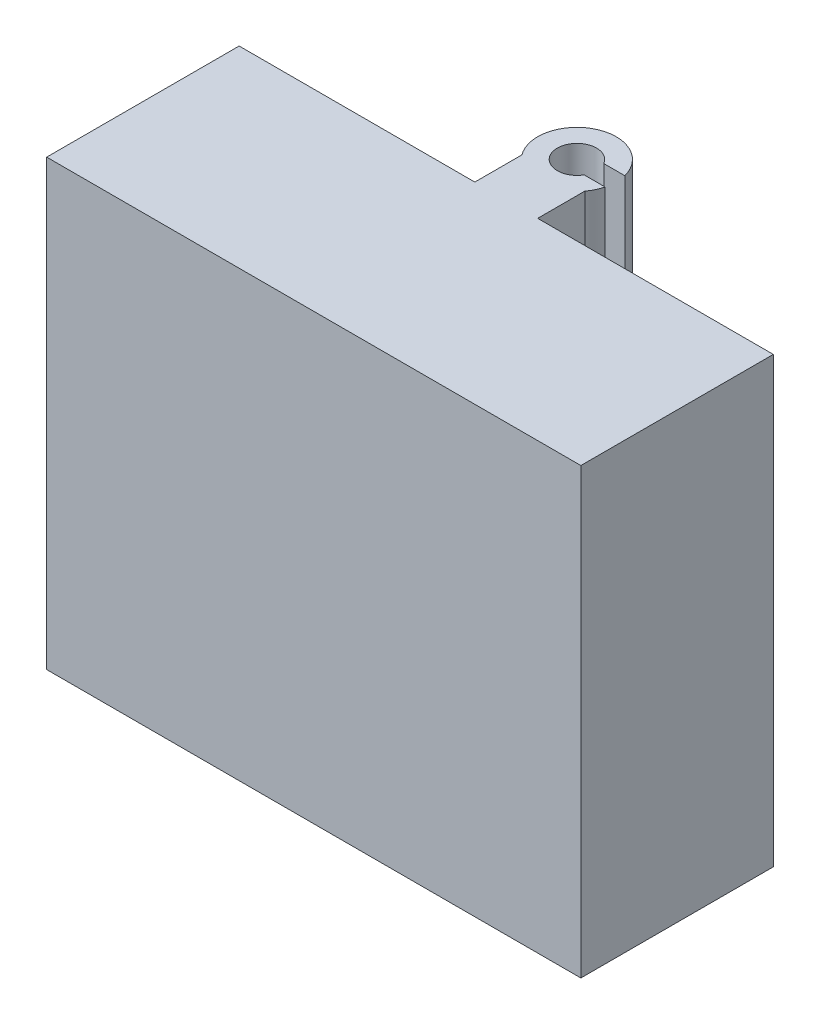
ISO-10303-21;
HEADER;
FILE_DESCRIPTION(('STEP AP214'),'2;1');
FILE_NAME('part.step','',(''),(''),'','','');
FILE_SCHEMA(('AUTOMOTIVE_DESIGN { 1 0 10303 214 1 1 1 1 }'));
ENDSEC;
DATA;
#1=APPLICATION_CONTEXT('core data for automotive mechanical design processes');
#2=APPLICATION_PROTOCOL_DEFINITION('international standard','automotive_design',2000,#1);
#3=PRODUCT_CONTEXT('',#1,'mechanical');
#4=PRODUCT('Part','Part','',(#3));
#5=PRODUCT_RELATED_PRODUCT_CATEGORY('part','',(#4));
#6=PRODUCT_DEFINITION_FORMATION('','',#4);
#7=PRODUCT_DEFINITION_CONTEXT('part definition',#1,'design');
#8=PRODUCT_DEFINITION('design','',#6,#7);
#9=PRODUCT_DEFINITION_SHAPE('','',#8);
#10=(LENGTH_UNIT() NAMED_UNIT(*) SI_UNIT(.MILLI.,.METRE.));
#11=(NAMED_UNIT(*) PLANE_ANGLE_UNIT() SI_UNIT($,.RADIAN.));
#12=(NAMED_UNIT(*) SI_UNIT($,.STERADIAN.) SOLID_ANGLE_UNIT());
#13=UNCERTAINTY_MEASURE_WITH_UNIT(LENGTH_MEASURE(1.E-05),#10,'distance_accuracy_value','');
#14=(GEOMETRIC_REPRESENTATION_CONTEXT(3) GLOBAL_UNCERTAINTY_ASSIGNED_CONTEXT((#13)) GLOBAL_UNIT_ASSIGNED_CONTEXT((#10,
#11,#12)) REPRESENTATION_CONTEXT('',''));
#15=CARTESIAN_POINT('',(0.,0.,0.));
#16=DIRECTION('',(0.,0.,1.));
#17=DIRECTION('',(1.,0.,0.));
#18=AXIS2_PLACEMENT_3D('',#15,#16,#17);
#19=CARTESIAN_POINT('',(38.,0.,-6.));
#20=DIRECTION('',(-1.,0.,0.));
#21=DIRECTION('',(0.,-1.,0.));
#22=AXIS2_PLACEMENT_3D('',#19,#20,#21);
#23=PLANE('',#22);
#24=DIRECTION('',(0.,0.,1.));
#25=VECTOR('',#24,1.);
#26=CARTESIAN_POINT('',(38.,-23.5,-6.));
#27=LINE('',#26,#25);
#28=CARTESIAN_POINT('',(38.,-23.5,-6.));
#29=VERTEX_POINT('',#28);
#30=CARTESIAN_POINT('',(38.,-23.5,0.));
#31=VERTEX_POINT('',#30);
#32=EDGE_CURVE('E158',#29,#31,#27,.T.);
#33=ORIENTED_EDGE('',*,*,#32,.F.);
#34=DIRECTION('',(0.,-1.,0.));
#35=VECTOR('',#34,1.);
#36=CARTESIAN_POINT('',(38.,0.,-6.));
#37=LINE('',#36,#35);
#38=CARTESIAN_POINT('',(38.,0.,-6.));
#39=VERTEX_POINT('',#38);
#40=EDGE_CURVE('E178',#39,#29,#37,.T.);
#41=ORIENTED_EDGE('',*,*,#40,.F.);
#42=DIRECTION('',(0.,0.,1.));
#43=VECTOR('',#42,1.);
#44=CARTESIAN_POINT('',(38.,0.,-6.));
#45=LINE('',#44,#43);
#46=CARTESIAN_POINT('',(38.,0.,0.));
#47=VERTEX_POINT('',#46);
#48=EDGE_CURVE('E188',#39,#47,#45,.T.);
#49=ORIENTED_EDGE('',*,*,#48,.T.);
#50=DIRECTION('',(0.,-1.,0.));
#51=VECTOR('',#50,1.);
#52=CARTESIAN_POINT('',(38.,0.,0.));
#53=LINE('',#52,#51);
#54=EDGE_CURVE('E64',#47,#31,#53,.T.);
#55=ORIENTED_EDGE('',*,*,#54,.T.);
#56=EDGE_LOOP('',(#33,#41,#49,#55));
#57=FACE_BOUND('',#56,.T.);
#58=ADVANCED_FACE('F41',(#57),#23,.F.);
#59=CARTESIAN_POINT('',(30.,0.,-6.));
#60=DIRECTION('',(1.,0.,0.));
#61=DIRECTION('',(0.,1.,0.));
#62=AXIS2_PLACEMENT_3D('',#59,#60,#61);
#63=PLANE('',#62);
#64=DIRECTION('',(0.,0.,-1.));
#65=VECTOR('',#64,1.);
#66=CARTESIAN_POINT('',(30.,-23.5,-6.));
#67=LINE('',#66,#65);
#68=CARTESIAN_POINT('',(30.,-23.5,0.));
#69=VERTEX_POINT('',#68);
#70=CARTESIAN_POINT('',(30.,-23.5,-6.));
#71=VERTEX_POINT('',#70);
#72=EDGE_CURVE('E156',#69,#71,#67,.T.);
#73=ORIENTED_EDGE('',*,*,#72,.F.);
#74=DIRECTION('',(0.,1.,0.));
#75=VECTOR('',#74,1.);
#76=CARTESIAN_POINT('',(30.,0.,0.));
#77=LINE('',#76,#75);
#78=CARTESIAN_POINT('',(30.,0.,0.));
#79=VERTEX_POINT('',#78);
#80=EDGE_CURVE('E166',#69,#79,#77,.T.);
#81=ORIENTED_EDGE('',*,*,#80,.T.);
#82=DIRECTION('',(0.,0.,1.));
#83=VECTOR('',#82,1.);
#84=CARTESIAN_POINT('',(30.,0.,-6.));
#85=LINE('',#84,#83);
#86=CARTESIAN_POINT('',(30.,0.,-6.));
#87=VERTEX_POINT('',#86);
#88=EDGE_CURVE('E192',#87,#79,#85,.T.);
#89=ORIENTED_EDGE('',*,*,#88,.F.);
#90=DIRECTION('',(0.,1.,0.));
#91=VECTOR('',#90,1.);
#92=CARTESIAN_POINT('',(30.,0.,-6.));
#93=LINE('',#92,#91);
#94=EDGE_CURVE('E168',#71,#87,#93,.T.);
#95=ORIENTED_EDGE('',*,*,#94,.F.);
#96=EDGE_LOOP('',(#73,#81,#89,#95));
#97=FACE_BOUND('',#96,.T.);
#98=ADVANCED_FACE('F164',(#97),#63,.F.);
#99=CARTESIAN_POINT('',(34.,-56.5,-9.));
#100=DIRECTION('',(0.,1.,0.));
#101=DIRECTION('',(0.,0.,1.));
#102=AXIS2_PLACEMENT_3D('',#99,#100,#101);
#103=CYLINDRICAL_SURFACE('',#102,2.49999282434763);
#104=CARTESIAN_POINT('',(34.,-23.5,-9.));
#105=DIRECTION('',(0.,-1.,0.));
#106=DIRECTION('',(0.,0.,-1.));
#107=AXIS2_PLACEMENT_3D('',#104,#105,#106);
#108=CIRCLE('',#107,2.49999282434763);
#109=CARTESIAN_POINT('',(36.1650552237275,-23.5,-10.25));
#110=VERTEX_POINT('',#109);
#111=CARTESIAN_POINT('',(36.1650552237275,-23.5,-7.75));
#112=VERTEX_POINT('',#111);
#113=EDGE_CURVE('E171',#110,#112,#108,.F.);
#114=ORIENTED_EDGE('',*,*,#113,.F.);
#115=DIRECTION('',(0.,1.,0.));
#116=VECTOR('',#115,1.);
#117=CARTESIAN_POINT('',(36.1650552237275,-56.5,-10.25));
#118=LINE('',#117,#116);
#119=CARTESIAN_POINT('',(36.1650552237275,0.,-10.25));
#120=VERTEX_POINT('',#119);
#121=EDGE_CURVE('E375',#110,#120,#118,.T.);
#122=ORIENTED_EDGE('',*,*,#121,.T.);
#123=CARTESIAN_POINT('',(34.,0.,-9.));
#124=DIRECTION('',(0.,1.,0.));
#125=DIRECTION('',(0.,0.,1.));
#126=AXIS2_PLACEMENT_3D('',#123,#124,#125);
#127=CIRCLE('',#126,2.49999282434763);
#128=CARTESIAN_POINT('',(36.1650552237275,0.,-7.75));
#129=VERTEX_POINT('',#128);
#130=EDGE_CURVE('E405',#120,#129,#127,.T.);
#131=ORIENTED_EDGE('',*,*,#130,.T.);
#132=DIRECTION('',(0.,1.,0.));
#133=VECTOR('',#132,1.);
#134=CARTESIAN_POINT('',(36.1650552237275,-56.5,-7.75));
#135=LINE('',#134,#133);
#136=EDGE_CURVE('E184',#112,#129,#135,.T.);
#137=ORIENTED_EDGE('',*,*,#136,.F.);
#138=EDGE_LOOP('',(#114,#122,#131,#137));
#139=FACE_BOUND('',#138,.T.);
#140=ADVANCED_FACE('F312',(#139),#103,.F.);
#141=CARTESIAN_POINT('',(0.,-56.5,-7.75));
#142=DIRECTION('',(0.,0.,1.));
#143=DIRECTION('',(1.,0.,0.));
#144=AXIS2_PLACEMENT_3D('',#141,#142,#143);
#145=PLANE('',#144);
#146=DIRECTION('',(1.,0.,0.));
#147=VECTOR('',#146,1.);
#148=CARTESIAN_POINT('',(0.,-23.5,-7.75));
#149=LINE('',#148,#147);
#150=CARTESIAN_POINT('',(38.8412291827593,-23.5,-7.75));
#151=VERTEX_POINT('',#150);
#152=EDGE_CURVE('E170',#112,#151,#149,.T.);
#153=ORIENTED_EDGE('',*,*,#152,.F.);
#154=ORIENTED_EDGE('',*,*,#136,.T.);
#155=DIRECTION('',(1.,0.,0.));
#156=VECTOR('',#155,1.);
#157=CARTESIAN_POINT('',(0.,0.,-7.75));
#158=LINE('',#157,#156);
#159=CARTESIAN_POINT('',(38.8412291827593,0.,-7.75));
#160=VERTEX_POINT('',#159);
#161=EDGE_CURVE('E386',#129,#160,#158,.T.);
#162=ORIENTED_EDGE('',*,*,#161,.T.);
#163=DIRECTION('',(0.,1.,0.));
#164=VECTOR('',#163,1.);
#165=CARTESIAN_POINT('',(38.8412291827593,-56.5,-7.75));
#166=LINE('',#165,#164);
#167=EDGE_CURVE('E390',#151,#160,#166,.T.);
#168=ORIENTED_EDGE('',*,*,#167,.F.);
#169=EDGE_LOOP('',(#153,#154,#162,#168));
#170=FACE_BOUND('',#169,.T.);
#171=ADVANCED_FACE('F366',(#170),#145,.F.);
#172=CARTESIAN_POINT('',(34.,-56.5,-9.));
#173=DIRECTION('',(0.,1.,0.));
#174=DIRECTION('',(0.,0.,1.));
#175=AXIS2_PLACEMENT_3D('',#172,#173,#174);
#176=CYLINDRICAL_SURFACE('',#175,5.);
#177=ORIENTED_EDGE('',*,*,#40,.T.);
#178=CARTESIAN_POINT('',(34.,-23.5,-9.));
#179=DIRECTION('',(0.,-1.,0.));
#180=DIRECTION('',(0.,0.,-1.));
#181=AXIS2_PLACEMENT_3D('',#178,#179,#180);
#182=CIRCLE('',#181,5.);
#183=EDGE_CURVE('E415',#29,#151,#182,.F.);
#184=ORIENTED_EDGE('',*,*,#183,.T.);
#185=ORIENTED_EDGE('',*,*,#167,.T.);
#186=CARTESIAN_POINT('',(34.,0.,-9.));
#187=DIRECTION('',(0.,1.,0.));
#188=DIRECTION('',(0.,0.,1.));
#189=AXIS2_PLACEMENT_3D('',#186,#187,#188);
#190=CIRCLE('',#189,5.);
#191=EDGE_CURVE('E393',#39,#160,#190,.T.);
#192=ORIENTED_EDGE('',*,*,#191,.F.);
#193=EDGE_LOOP('',(#177,#184,#185,#192));
#194=FACE_BOUND('',#193,.T.);
#195=ADVANCED_FACE('F360',(#194),#176,.T.);
#196=DIRECTION('',(0.,1.,0.));
#197=VECTOR('',#196,1.);
#198=CARTESIAN_POINT('',(38.8412291827593,-56.5,-10.25));
#199=LINE('',#198,#197);
#200=CARTESIAN_POINT('',(38.8412291827593,-23.5,-10.25));
#201=VERTEX_POINT('',#200);
#202=CARTESIAN_POINT('',(38.8412291827593,0.,-10.25));
#203=VERTEX_POINT('',#202);
#204=EDGE_CURVE('E385',#201,#203,#199,.T.);
#205=ORIENTED_EDGE('',*,*,#204,.F.);
#206=CARTESIAN_POINT('',(34.,-23.5,-9.));
#207=DIRECTION('',(0.,-1.,0.));
#208=DIRECTION('',(0.,0.,-1.));
#209=AXIS2_PLACEMENT_3D('',#206,#207,#208);
#210=CIRCLE('',#209,5.);
#211=EDGE_CURVE('E57',#201,#71,#210,.F.);
#212=ORIENTED_EDGE('',*,*,#211,.T.);
#213=ORIENTED_EDGE('',*,*,#94,.T.);
#214=EDGE_CURVE('E399',#203,#87,#190,.T.);
#215=ORIENTED_EDGE('',*,*,#214,.F.);
#216=EDGE_LOOP('',(#205,#212,#213,#215));
#217=FACE_BOUND('',#216,.T.);
#218=ADVANCED_FACE('F354',(#217),#176,.T.);
#219=CARTESIAN_POINT('',(0.,-56.5,-10.25));
#220=DIRECTION('',(0.,0.,1.));
#221=DIRECTION('',(1.,0.,0.));
#222=AXIS2_PLACEMENT_3D('',#219,#220,#221);
#223=PLANE('',#222);
#224=ORIENTED_EDGE('',*,*,#121,.F.);
#225=DIRECTION('',(1.,0.,0.));
#226=VECTOR('',#225,1.);
#227=CARTESIAN_POINT('',(0.,-23.5,-10.25));
#228=LINE('',#227,#226);
#229=EDGE_CURVE('E11',#110,#201,#228,.T.);
#230=ORIENTED_EDGE('',*,*,#229,.T.);
#231=ORIENTED_EDGE('',*,*,#204,.T.);
#232=DIRECTION('',(1.,0.,0.));
#233=VECTOR('',#232,1.);
#234=CARTESIAN_POINT('',(0.,0.,-10.25));
#235=LINE('',#234,#233);
#236=EDGE_CURVE('E383',#120,#203,#235,.T.);
#237=ORIENTED_EDGE('',*,*,#236,.F.);
#238=EDGE_LOOP('',(#224,#230,#231,#237));
#239=FACE_BOUND('',#238,.T.);
#240=ADVANCED_FACE('F350',(#239),#223,.T.);
#241=CARTESIAN_POINT('',(0.,-56.5,24.5));
#242=DIRECTION('',(1.,0.,0.));
#243=DIRECTION('',(0.,0.,-1.));
#244=AXIS2_PLACEMENT_3D('',#241,#242,#243);
#245=PLANE('',#244);
#246=DIRECTION('',(0.,-1.,0.));
#247=VECTOR('',#246,1.);
#248=CARTESIAN_POINT('',(0.,-56.5,0.));
#249=LINE('',#248,#247);
#250=CARTESIAN_POINT('',(0.,0.,0.));
#251=VERTEX_POINT('',#250);
#252=CARTESIAN_POINT('',(0.,-56.5,0.));
#253=VERTEX_POINT('',#252);
#254=EDGE_CURVE('E230',#251,#253,#249,.T.);
#255=ORIENTED_EDGE('',*,*,#254,.T.);
#256=DIRECTION('',(0.,0.,-1.));
#257=VECTOR('',#256,1.);
#258=CARTESIAN_POINT('',(0.,-56.5,24.5));
#259=LINE('',#258,#257);
#260=CARTESIAN_POINT('',(0.,-56.5,24.5));
#261=VERTEX_POINT('',#260);
#262=EDGE_CURVE('E50',#261,#253,#259,.T.);
#263=ORIENTED_EDGE('',*,*,#262,.F.);
#264=DIRECTION('',(0.,-1.,0.));
#265=VECTOR('',#264,1.);
#266=CARTESIAN_POINT('',(0.,-56.5,24.5));
#267=LINE('',#266,#265);
#268=CARTESIAN_POINT('',(0.,0.,24.5));
#269=VERTEX_POINT('',#268);
#270=EDGE_CURVE('E240',#269,#261,#267,.T.);
#271=ORIENTED_EDGE('',*,*,#270,.F.);
#272=DIRECTION('',(0.,0.,-1.));
#273=VECTOR('',#272,1.);
#274=CARTESIAN_POINT('',(0.,0.,24.5));
#275=LINE('',#274,#273);
#276=EDGE_CURVE('E254',#269,#251,#275,.T.);
#277=ORIENTED_EDGE('',*,*,#276,.T.);
#278=EDGE_LOOP('',(#255,#263,#271,#277));
#279=FACE_BOUND('',#278,.T.);
#280=ADVANCED_FACE('F43',(#279),#245,.F.);
#281=CARTESIAN_POINT('',(68.,-56.5,24.5));
#282=DIRECTION('',(0.,1.,0.));
#283=DIRECTION('',(-1.,0.,0.));
#284=AXIS2_PLACEMENT_3D('',#281,#282,#283);
#285=PLANE('',#284);
#286=DIRECTION('',(0.,0.,-1.));
#287=VECTOR('',#286,1.);
#288=CARTESIAN_POINT('',(1.45,-56.5,23.));
#289=LINE('',#288,#287);
#290=CARTESIAN_POINT('',(1.44999999999999,-56.5,23.));
#291=VERTEX_POINT('',#290);
#292=CARTESIAN_POINT('',(1.45,-56.5,1.49999999999999));
#293=VERTEX_POINT('',#292);
#294=EDGE_CURVE('E216',#291,#293,#289,.T.);
#295=ORIENTED_EDGE('',*,*,#294,.F.);
#296=DIRECTION('',(-1.,0.,0.));
#297=VECTOR('',#296,1.);
#298=CARTESIAN_POINT('',(66.55,-56.5,23.));
#299=LINE('',#298,#297);
#300=CARTESIAN_POINT('',(66.55,-56.5,23.));
#301=VERTEX_POINT('',#300);
#302=EDGE_CURVE('E195',#301,#291,#299,.T.);
#303=ORIENTED_EDGE('',*,*,#302,.F.);
#304=DIRECTION('',(0.,0.,1.));
#305=VECTOR('',#304,1.);
#306=CARTESIAN_POINT('',(66.55,-56.5,23.));
#307=LINE('',#306,#305);
#308=CARTESIAN_POINT('',(66.55,-56.5,1.49999999999999));
#309=VERTEX_POINT('',#308);
#310=EDGE_CURVE('E201',#309,#301,#307,.T.);
#311=ORIENTED_EDGE('',*,*,#310,.F.);
#312=DIRECTION('',(1.,0.,0.));
#313=VECTOR('',#312,1.);
#314=CARTESIAN_POINT('',(1.45,-56.5,1.49999999999999));
#315=LINE('',#314,#313);
#316=EDGE_CURVE('E220',#293,#309,#315,.T.);
#317=ORIENTED_EDGE('',*,*,#316,.F.);
#318=EDGE_LOOP('',(#295,#303,#311,#317));
#319=FACE_BOUND('',#318,.T.);
#320=DIRECTION('',(1.,0.,0.));
#321=VECTOR('',#320,1.);
#322=CARTESIAN_POINT('',(68.,-56.5,0.));
#323=LINE('',#322,#321);
#324=CARTESIAN_POINT('',(68.,-56.5,0.));
#325=VERTEX_POINT('',#324);
#326=EDGE_CURVE('E258',#253,#325,#323,.T.);
#327=ORIENTED_EDGE('',*,*,#326,.T.);
#328=DIRECTION('',(0.,0.,-1.));
#329=VECTOR('',#328,1.);
#330=CARTESIAN_POINT('',(68.,-56.5,24.5));
#331=LINE('',#330,#329);
#332=CARTESIAN_POINT('',(68.,-56.5,24.5));
#333=VERTEX_POINT('',#332);
#334=EDGE_CURVE('E273',#333,#325,#331,.T.);
#335=ORIENTED_EDGE('',*,*,#334,.F.);
#336=DIRECTION('',(1.,0.,0.));
#337=VECTOR('',#336,1.);
#338=CARTESIAN_POINT('',(68.,-56.5,24.5));
#339=LINE('',#338,#337);
#340=EDGE_CURVE('E244',#261,#333,#339,.T.);
#341=ORIENTED_EDGE('',*,*,#340,.F.);
#342=ORIENTED_EDGE('',*,*,#262,.T.);
#343=EDGE_LOOP('',(#327,#335,#341,#342));
#344=FACE_BOUND('',#343,.T.);
#345=ADVANCED_FACE('F280',(#319,#344),#285,.F.);
#346=CARTESIAN_POINT('',(68.,0.,24.5));
#347=DIRECTION('',(-1.,0.,0.));
#348=DIRECTION('',(0.,0.,1.));
#349=AXIS2_PLACEMENT_3D('',#346,#347,#348);
#350=PLANE('',#349);
#351=DIRECTION('',(0.,1.,0.));
#352=VECTOR('',#351,1.);
#353=CARTESIAN_POINT('',(68.,0.,0.));
#354=LINE('',#353,#352);
#355=CARTESIAN_POINT('',(68.,0.,0.));
#356=VERTEX_POINT('',#355);
#357=EDGE_CURVE('E261',#325,#356,#354,.T.);
#358=ORIENTED_EDGE('',*,*,#357,.T.);
#359=DIRECTION('',(0.,0.,-1.));
#360=VECTOR('',#359,1.);
#361=CARTESIAN_POINT('',(68.,0.,24.5));
#362=LINE('',#361,#360);
#363=CARTESIAN_POINT('',(68.,0.,24.5));
#364=VERTEX_POINT('',#363);
#365=EDGE_CURVE('E269',#364,#356,#362,.T.);
#366=ORIENTED_EDGE('',*,*,#365,.F.);
#367=DIRECTION('',(0.,1.,0.));
#368=VECTOR('',#367,1.);
#369=CARTESIAN_POINT('',(68.,0.,24.5));
#370=LINE('',#369,#368);
#371=EDGE_CURVE('E248',#333,#364,#370,.T.);
#372=ORIENTED_EDGE('',*,*,#371,.F.);
#373=ORIENTED_EDGE('',*,*,#334,.T.);
#374=EDGE_LOOP('',(#358,#366,#372,#373));
#375=FACE_BOUND('',#374,.T.);
#376=ADVANCED_FACE('F288',(#375),#350,.F.);
#377=CARTESIAN_POINT('',(0.,0.,24.5));
#378=DIRECTION('',(0.,-1.,0.));
#379=DIRECTION('',(0.,0.,-1.));
#380=AXIS2_PLACEMENT_3D('',#377,#378,#379);
#381=PLANE('',#380);
#382=DIRECTION('',(-1.,0.,0.));
#383=VECTOR('',#382,1.);
#384=CARTESIAN_POINT('',(0.,0.,0.));
#385=LINE('',#384,#383);
#386=EDGE_CURVE('E245',#356,#47,#385,.T.);
#387=ORIENTED_EDGE('',*,*,#386,.T.);
#388=ORIENTED_EDGE('',*,*,#48,.F.);
#389=ORIENTED_EDGE('',*,*,#191,.T.);
#390=ORIENTED_EDGE('',*,*,#161,.F.);
#391=ORIENTED_EDGE('',*,*,#130,.F.);
#392=ORIENTED_EDGE('',*,*,#236,.T.);
#393=ORIENTED_EDGE('',*,*,#214,.T.);
#394=ORIENTED_EDGE('',*,*,#88,.T.);
#395=EDGE_CURVE('E175',#79,#251,#385,.T.);
#396=ORIENTED_EDGE('',*,*,#395,.T.);
#397=ORIENTED_EDGE('',*,*,#276,.F.);
#398=DIRECTION('',(-1.,0.,0.));
#399=VECTOR('',#398,1.);
#400=CARTESIAN_POINT('',(0.,0.,24.5));
#401=LINE('',#400,#399);
#402=EDGE_CURVE('E251',#364,#269,#401,.T.);
#403=ORIENTED_EDGE('',*,*,#402,.F.);
#404=ORIENTED_EDGE('',*,*,#365,.T.);
#405=EDGE_LOOP('',(#387,#388,#389,#390,#391,#392,#393,#394,#396,#397,#403,#404));
#406=FACE_BOUND('',#405,.T.);
#407=ADVANCED_FACE('F292',(#406),#381,.F.);
#408=CARTESIAN_POINT('',(0.,0.,24.5));
#409=DIRECTION('',(0.,0.,-1.));
#410=DIRECTION('',(-1.,0.,0.));
#411=AXIS2_PLACEMENT_3D('',#408,#409,#410);
#412=PLANE('',#411);
#413=ORIENTED_EDGE('',*,*,#270,.T.);
#414=ORIENTED_EDGE('',*,*,#340,.T.);
#415=ORIENTED_EDGE('',*,*,#371,.T.);
#416=ORIENTED_EDGE('',*,*,#402,.T.);
#417=EDGE_LOOP('',(#413,#414,#415,#416));
#418=FACE_BOUND('',#417,.T.);
#419=ADVANCED_FACE('F295',(#418),#412,.F.);
#420=CARTESIAN_POINT('',(0.,0.,0.));
#421=DIRECTION('',(0.,0.,-1.));
#422=DIRECTION('',(-1.,0.,0.));
#423=AXIS2_PLACEMENT_3D('',#420,#421,#422);
#424=PLANE('',#423);
#425=DIRECTION('',(1.,0.,0.));
#426=VECTOR('',#425,1.);
#427=CARTESIAN_POINT('',(43.3970108527362,-23.5,0.));
#428=LINE('',#427,#426);
#429=EDGE_CURVE('E153',#69,#31,#428,.T.);
#430=ORIENTED_EDGE('',*,*,#429,.T.);
#431=ORIENTED_EDGE('',*,*,#54,.F.);
#432=ORIENTED_EDGE('',*,*,#386,.F.);
#433=ORIENTED_EDGE('',*,*,#357,.F.);
#434=ORIENTED_EDGE('',*,*,#326,.F.);
#435=ORIENTED_EDGE('',*,*,#254,.F.);
#436=ORIENTED_EDGE('',*,*,#395,.F.);
#437=ORIENTED_EDGE('',*,*,#80,.F.);
#438=EDGE_LOOP('',(#430,#431,#432,#433,#434,#435,#436,#437));
#439=FACE_BOUND('',#438,.T.);
#440=ADVANCED_FACE('F173',(#439),#424,.T.);
#441=CARTESIAN_POINT('',(66.55,-1.5,23.));
#442=DIRECTION('',(0.,0.,1.));
#443=DIRECTION('',(1.,0.,0.));
#444=AXIS2_PLACEMENT_3D('',#441,#442,#443);
#445=PLANE('',#444);
#446=ORIENTED_EDGE('',*,*,#302,.T.);
#447=DIRECTION('',(0.,-1.,0.));
#448=VECTOR('',#447,1.);
#449=CARTESIAN_POINT('',(1.44999999999999,-1.50000000000001,23.));
#450=LINE('',#449,#448);
#451=CARTESIAN_POINT('',(1.44999999999999,-1.50000000000001,23.));
#452=VERTEX_POINT('',#451);
#453=EDGE_CURVE('E213',#452,#291,#450,.T.);
#454=ORIENTED_EDGE('',*,*,#453,.F.);
#455=DIRECTION('',(-1.,0.,0.));
#456=VECTOR('',#455,1.);
#457=CARTESIAN_POINT('',(66.55,-1.5,23.));
#458=LINE('',#457,#456);
#459=CARTESIAN_POINT('',(66.55,-1.5,23.));
#460=VERTEX_POINT('',#459);
#461=EDGE_CURVE('E196',#460,#452,#458,.T.);
#462=ORIENTED_EDGE('',*,*,#461,.F.);
#463=DIRECTION('',(0.,-1.,0.));
#464=VECTOR('',#463,1.);
#465=CARTESIAN_POINT('',(66.55,-1.5,23.));
#466=LINE('',#465,#464);
#467=EDGE_CURVE('E227',#460,#301,#466,.T.);
#468=ORIENTED_EDGE('',*,*,#467,.T.);
#469=EDGE_LOOP('',(#446,#454,#462,#468));
#470=FACE_BOUND('',#469,.T.);
#471=ADVANCED_FACE('F302',(#470),#445,.F.);
#472=CARTESIAN_POINT('',(66.55,-1.5,23.));
#473=DIRECTION('',(1.,0.,0.));
#474=DIRECTION('',(0.,1.,0.));
#475=AXIS2_PLACEMENT_3D('',#472,#473,#474);
#476=PLANE('',#475);
#477=ORIENTED_EDGE('',*,*,#310,.T.);
#478=ORIENTED_EDGE('',*,*,#467,.F.);
#479=DIRECTION('',(0.,0.,1.));
#480=VECTOR('',#479,1.);
#481=CARTESIAN_POINT('',(66.55,-1.5,23.));
#482=LINE('',#481,#480);
#483=CARTESIAN_POINT('',(66.55,-1.5,1.49999999999999));
#484=VERTEX_POINT('',#483);
#485=EDGE_CURVE('E209',#484,#460,#482,.T.);
#486=ORIENTED_EDGE('',*,*,#485,.F.);
#487=DIRECTION('',(0.,-1.,0.));
#488=VECTOR('',#487,1.);
#489=CARTESIAN_POINT('',(66.55,-1.5,1.49999999999999));
#490=LINE('',#489,#488);
#491=EDGE_CURVE('E231',#484,#309,#490,.T.);
#492=ORIENTED_EDGE('',*,*,#491,.T.);
#493=EDGE_LOOP('',(#477,#478,#486,#492));
#494=FACE_BOUND('',#493,.T.);
#495=ADVANCED_FACE('F321',(#494),#476,.F.);
#496=CARTESIAN_POINT('',(1.44999999999999,-1.50000000000001,1.49999999999999));
#497=DIRECTION('',(0.,0.,-1.));
#498=DIRECTION('',(-1.,0.,0.));
#499=AXIS2_PLACEMENT_3D('',#496,#497,#498);
#500=PLANE('',#499);
#501=ORIENTED_EDGE('',*,*,#316,.T.);
#502=ORIENTED_EDGE('',*,*,#491,.F.);
#503=DIRECTION('',(1.,0.,0.));
#504=VECTOR('',#503,1.);
#505=CARTESIAN_POINT('',(1.44999999999999,-1.50000000000001,1.49999999999999));
#506=LINE('',#505,#504);
#507=CARTESIAN_POINT('',(1.44999999999999,-1.50000000000001,1.49999999999999));
#508=VERTEX_POINT('',#507);
#509=EDGE_CURVE('E205',#508,#484,#506,.T.);
#510=ORIENTED_EDGE('',*,*,#509,.F.);
#511=DIRECTION('',(0.,-1.,0.));
#512=VECTOR('',#511,1.);
#513=CARTESIAN_POINT('',(1.44999999999999,-1.50000000000001,1.49999999999999));
#514=LINE('',#513,#512);
#515=EDGE_CURVE('E234',#508,#293,#514,.T.);
#516=ORIENTED_EDGE('',*,*,#515,.T.);
#517=EDGE_LOOP('',(#501,#502,#510,#516));
#518=FACE_BOUND('',#517,.T.);
#519=ADVANCED_FACE('F324',(#518),#500,.F.);
#520=CARTESIAN_POINT('',(1.44999999999999,-1.50000000000001,23.));
#521=DIRECTION('',(-1.,0.,0.));
#522=DIRECTION('',(0.,-1.,0.));
#523=AXIS2_PLACEMENT_3D('',#520,#521,#522);
#524=PLANE('',#523);
#525=ORIENTED_EDGE('',*,*,#294,.T.);
#526=ORIENTED_EDGE('',*,*,#515,.F.);
#527=DIRECTION('',(0.,0.,-1.));
#528=VECTOR('',#527,1.);
#529=CARTESIAN_POINT('',(1.44999999999999,-1.50000000000001,23.));
#530=LINE('',#529,#528);
#531=EDGE_CURVE('E200',#452,#508,#530,.T.);
#532=ORIENTED_EDGE('',*,*,#531,.F.);
#533=ORIENTED_EDGE('',*,*,#453,.T.);
#534=EDGE_LOOP('',(#525,#526,#532,#533));
#535=FACE_BOUND('',#534,.T.);
#536=ADVANCED_FACE('F319',(#535),#524,.F.);
#537=CARTESIAN_POINT('',(0.,-1.50000000000001,0.));
#538=DIRECTION('',(0.,-1.,0.));
#539=DIRECTION('',(1.,0.,0.));
#540=AXIS2_PLACEMENT_3D('',#537,#538,#539);
#541=PLANE('',#540);
#542=ORIENTED_EDGE('',*,*,#461,.T.);
#543=ORIENTED_EDGE('',*,*,#531,.T.);
#544=ORIENTED_EDGE('',*,*,#509,.T.);
#545=ORIENTED_EDGE('',*,*,#485,.T.);
#546=EDGE_LOOP('',(#542,#543,#544,#545));
#547=FACE_BOUND('',#546,.T.);
#548=ADVANCED_FACE('F316',(#547),#541,.T.);
#549=CARTESIAN_POINT('',(43.3970108527362,-23.5,-15.));
#550=DIRECTION('',(0.,-1.,0.));
#551=DIRECTION('',(0.,0.,-1.));
#552=AXIS2_PLACEMENT_3D('',#549,#550,#551);
#553=PLANE('',#552);
#554=ORIENTED_EDGE('',*,*,#32,.T.);
#555=ORIENTED_EDGE('',*,*,#429,.F.);
#556=ORIENTED_EDGE('',*,*,#72,.T.);
#557=ORIENTED_EDGE('',*,*,#211,.F.);
#558=ORIENTED_EDGE('',*,*,#229,.F.);
#559=ORIENTED_EDGE('',*,*,#113,.T.);
#560=ORIENTED_EDGE('',*,*,#152,.T.);
#561=ORIENTED_EDGE('',*,*,#183,.F.);
#562=EDGE_LOOP('',(#554,#555,#556,#557,#558,#559,#560,#561));
#563=FACE_BOUND('',#562,.T.);
#564=ADVANCED_FACE('F155',(#563),#553,.T.);
#565=CLOSED_SHELL('',(#58,#98,#140,#171,#195,#218,#240,#280,#345,#376,#407,#419,#440,#471,#495,
#519,#536,#548,#564));
#566=MANIFOLD_SOLID_BREP('B2',#565);
#567=ADVANCED_BREP_SHAPE_REPRESENTATION('',(#18,#566),#14);
#568=SHAPE_DEFINITION_REPRESENTATION(#9,#567);
ENDSEC;
END-ISO-10303-21;
